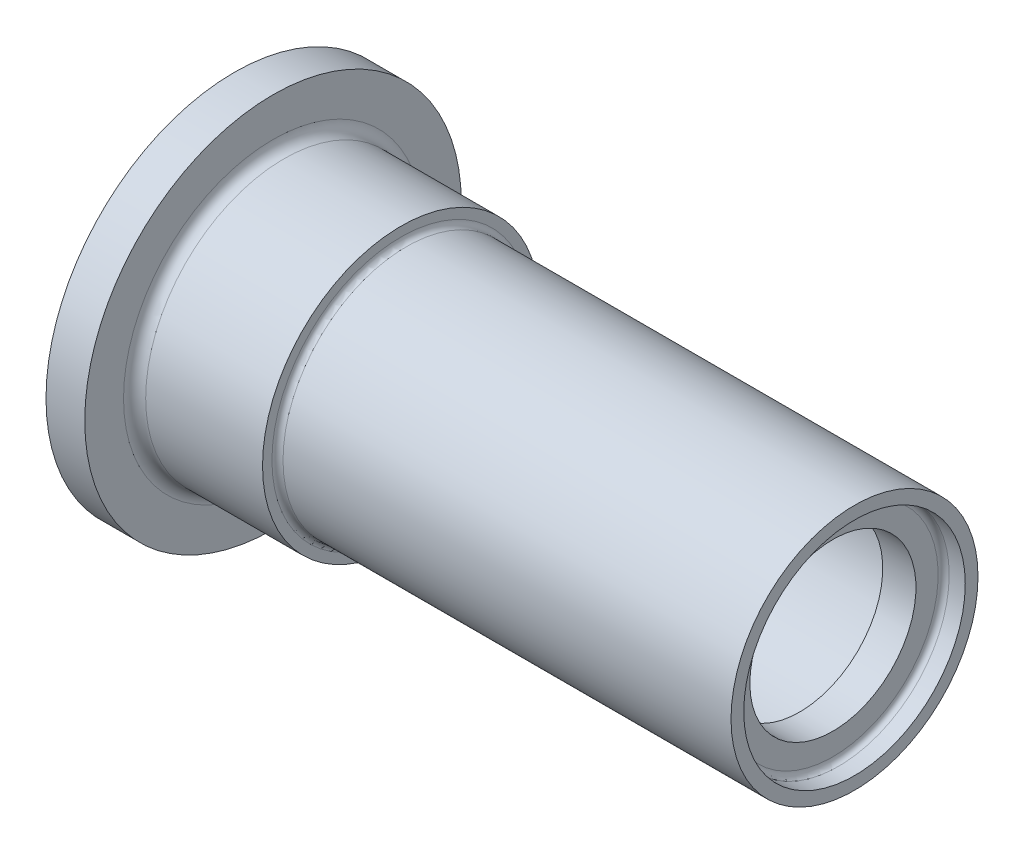
ISO-10303-21;
HEADER;
FILE_DESCRIPTION(('STEP AP214'),'2;1');
FILE_NAME('part.step','',(''),(''),'','','');
FILE_SCHEMA(('AUTOMOTIVE_DESIGN { 1 0 10303 214 1 1 1 1 }'));
ENDSEC;
DATA;
#1=APPLICATION_CONTEXT('core data for automotive mechanical design processes');
#2=APPLICATION_PROTOCOL_DEFINITION('international standard','automotive_design',2000,#1);
#3=PRODUCT_CONTEXT('',#1,'mechanical');
#4=PRODUCT('Part','Part','',(#3));
#5=PRODUCT_RELATED_PRODUCT_CATEGORY('part','',(#4));
#6=PRODUCT_DEFINITION_FORMATION('','',#4);
#7=PRODUCT_DEFINITION_CONTEXT('part definition',#1,'design');
#8=PRODUCT_DEFINITION('design','',#6,#7);
#9=PRODUCT_DEFINITION_SHAPE('','',#8);
#10=(LENGTH_UNIT() NAMED_UNIT(*) SI_UNIT(.MILLI.,.METRE.));
#11=(NAMED_UNIT(*) PLANE_ANGLE_UNIT() SI_UNIT($,.RADIAN.));
#12=(NAMED_UNIT(*) SI_UNIT($,.STERADIAN.) SOLID_ANGLE_UNIT());
#13=UNCERTAINTY_MEASURE_WITH_UNIT(LENGTH_MEASURE(1.E-05),#10,'distance_accuracy_value','');
#14=(GEOMETRIC_REPRESENTATION_CONTEXT(3) GLOBAL_UNCERTAINTY_ASSIGNED_CONTEXT((#13)) GLOBAL_UNIT_ASSIGNED_CONTEXT((#10,
#11,#12)) REPRESENTATION_CONTEXT('',''));
#15=CARTESIAN_POINT('',(0.,0.,0.));
#16=DIRECTION('',(0.,0.,1.));
#17=DIRECTION('',(1.,0.,0.));
#18=AXIS2_PLACEMENT_3D('',#15,#16,#17);
#19=CARTESIAN_POINT('',(-88.99,0.,0.));
#20=DIRECTION('',(-1.,0.,0.));
#21=DIRECTION('',(0.,0.,1.));
#22=AXIS2_PLACEMENT_3D('',#19,#20,#21);
#23=CYLINDRICAL_SURFACE('',#22,12.5);
#24=CARTESIAN_POINT('',(-10.55,0.,0.));
#25=DIRECTION('',(-1.,0.,0.));
#26=DIRECTION('',(0.,0.,1.));
#27=AXIS2_PLACEMENT_3D('',#24,#25,#26);
#28=CIRCLE('',#27,12.5);
#29=CARTESIAN_POINT('',(-10.55,0.,12.5));
#30=VERTEX_POINT('',#29);
#31=EDGE_CURVE('E10',#30,#30,#28,.T.);
#32=ORIENTED_EDGE('',*,*,#31,.F.);
#33=EDGE_LOOP('',(#32));
#34=FACE_BOUND('',#33,.T.);
#35=CARTESIAN_POINT('',(0.,0.,0.));
#36=DIRECTION('',(-1.,0.,0.));
#37=DIRECTION('',(0.,0.,1.));
#38=AXIS2_PLACEMENT_3D('',#35,#36,#37);
#39=CIRCLE('',#38,12.5);
#40=CARTESIAN_POINT('',(0.,0.,12.5));
#41=VERTEX_POINT('',#40);
#42=EDGE_CURVE('E121',#41,#41,#39,.T.);
#43=ORIENTED_EDGE('',*,*,#42,.T.);
#44=EDGE_LOOP('',(#43));
#45=FACE_BOUND('',#44,.T.);
#46=ADVANCED_FACE('F42',(#34,#45),#23,.T.);
#47=CARTESIAN_POINT('',(-10.55,0.,0.));
#48=DIRECTION('',(-1.,0.,0.));
#49=DIRECTION('',(0.,0.,1.));
#50=AXIS2_PLACEMENT_3D('',#47,#48,#49);
#51=TOROIDAL_SURFACE('',#50,13.5,1.);
#52=CARTESIAN_POINT('',(-11.55,0.,0.));
#53=DIRECTION('',(-1.,0.,0.));
#54=DIRECTION('',(0.,0.,1.));
#55=AXIS2_PLACEMENT_3D('',#52,#53,#54);
#56=CIRCLE('',#55,13.5);
#57=CARTESIAN_POINT('',(-11.55,0.,13.5));
#58=VERTEX_POINT('',#57);
#59=EDGE_CURVE('E49',#58,#58,#56,.T.);
#60=ORIENTED_EDGE('',*,*,#59,.F.);
#61=EDGE_LOOP('',(#60));
#62=FACE_BOUND('',#61,.T.);
#63=ORIENTED_EDGE('',*,*,#31,.T.);
#64=EDGE_LOOP('',(#63));
#65=FACE_BOUND('',#64,.T.);
#66=ADVANCED_FACE('F225',(#62,#65),#51,.F.);
#67=CARTESIAN_POINT('',(-11.55,17.,0.));
#68=DIRECTION('',(-1.,0.,0.));
#69=DIRECTION('',(0.,0.,1.));
#70=AXIS2_PLACEMENT_3D('',#67,#68,#69);
#71=PLANE('',#70);
#72=CARTESIAN_POINT('',(-11.55,0.,0.));
#73=DIRECTION('',(-1.,0.,0.));
#74=DIRECTION('',(0.,0.,1.));
#75=AXIS2_PLACEMENT_3D('',#72,#73,#74);
#76=CIRCLE('',#75,17.);
#77=CARTESIAN_POINT('',(-11.55,0.,17.));
#78=VERTEX_POINT('',#77);
#79=EDGE_CURVE('E54',#78,#78,#76,.T.);
#80=ORIENTED_EDGE('',*,*,#79,.F.);
#81=EDGE_LOOP('',(#80));
#82=FACE_BOUND('',#81,.T.);
#83=ORIENTED_EDGE('',*,*,#59,.T.);
#84=EDGE_LOOP('',(#83));
#85=FACE_BOUND('',#84,.T.);
#86=ADVANCED_FACE('F220',(#82,#85),#71,.F.);
#87=CARTESIAN_POINT('',(-88.99,0.,0.));
#88=DIRECTION('',(-1.,0.,0.));
#89=DIRECTION('',(0.,0.,1.));
#90=AXIS2_PLACEMENT_3D('',#87,#88,#89);
#91=CYLINDRICAL_SURFACE('',#90,17.);
#92=CARTESIAN_POINT('',(-15.05,0.,0.));
#93=DIRECTION('',(-1.,0.,0.));
#94=DIRECTION('',(0.,0.,1.));
#95=AXIS2_PLACEMENT_3D('',#92,#93,#94);
#96=CIRCLE('',#95,17.);
#97=CARTESIAN_POINT('',(-15.05,0.,17.));
#98=VERTEX_POINT('',#97);
#99=EDGE_CURVE('E59',#98,#98,#96,.T.);
#100=ORIENTED_EDGE('',*,*,#99,.F.);
#101=EDGE_LOOP('',(#100));
#102=FACE_BOUND('',#101,.T.);
#103=ORIENTED_EDGE('',*,*,#79,.T.);
#104=EDGE_LOOP('',(#103));
#105=FACE_BOUND('',#104,.T.);
#106=ADVANCED_FACE('F214',(#102,#105),#91,.T.);
#107=CARTESIAN_POINT('',(-15.05,15.,0.));
#108=DIRECTION('',(1.,0.,0.));
#109=DIRECTION('',(0.,0.,-1.));
#110=AXIS2_PLACEMENT_3D('',#107,#108,#109);
#111=PLANE('',#110);
#112=CARTESIAN_POINT('',(-15.05,0.,0.));
#113=DIRECTION('',(-1.,0.,0.));
#114=DIRECTION('',(0.,0.,1.));
#115=AXIS2_PLACEMENT_3D('',#112,#113,#114);
#116=CIRCLE('',#115,15.);
#117=CARTESIAN_POINT('',(-15.05,0.,15.));
#118=VERTEX_POINT('',#117);
#119=EDGE_CURVE('E65',#118,#118,#116,.T.);
#120=ORIENTED_EDGE('',*,*,#119,.F.);
#121=EDGE_LOOP('',(#120));
#122=FACE_BOUND('',#121,.T.);
#123=ORIENTED_EDGE('',*,*,#99,.T.);
#124=EDGE_LOOP('',(#123));
#125=FACE_BOUND('',#124,.T.);
#126=ADVANCED_FACE('F208',(#122,#125),#111,.F.);
#127=CARTESIAN_POINT('',(-88.99,0.,0.));
#128=DIRECTION('',(-1.,0.,0.));
#129=DIRECTION('',(0.,0.,1.));
#130=AXIS2_PLACEMENT_3D('',#127,#128,#129);
#131=CYLINDRICAL_SURFACE('',#130,15.);
#132=CARTESIAN_POINT('',(-14.05,0.,0.));
#133=DIRECTION('',(-1.,0.,0.));
#134=DIRECTION('',(0.,0.,1.));
#135=AXIS2_PLACEMENT_3D('',#132,#133,#134);
#136=CIRCLE('',#135,15.);
#137=CARTESIAN_POINT('',(-14.05,0.,15.));
#138=VERTEX_POINT('',#137);
#139=EDGE_CURVE('E69',#138,#138,#136,.T.);
#140=ORIENTED_EDGE('',*,*,#139,.F.);
#141=EDGE_LOOP('',(#140));
#142=FACE_BOUND('',#141,.T.);
#143=ORIENTED_EDGE('',*,*,#119,.T.);
#144=EDGE_LOOP('',(#143));
#145=FACE_BOUND('',#144,.T.);
#146=ADVANCED_FACE('F202',(#142,#145),#131,.F.);
#147=CARTESIAN_POINT('',(-14.05,0.,0.));
#148=DIRECTION('',(-1.,0.,0.));
#149=DIRECTION('',(0.,0.,1.));
#150=AXIS2_PLACEMENT_3D('',#147,#148,#149);
#151=TOROIDAL_SURFACE('',#150,14.5,0.5);
#152=CARTESIAN_POINT('',(-13.55,0.,0.));
#153=DIRECTION('',(-1.,0.,0.));
#154=DIRECTION('',(0.,0.,1.));
#155=AXIS2_PLACEMENT_3D('',#152,#153,#154);
#156=CIRCLE('',#155,14.5);
#157=CARTESIAN_POINT('',(-13.55,0.,14.5));
#158=VERTEX_POINT('',#157);
#159=EDGE_CURVE('E73',#158,#158,#156,.T.);
#160=ORIENTED_EDGE('',*,*,#159,.F.);
#161=EDGE_LOOP('',(#160));
#162=FACE_BOUND('',#161,.T.);
#163=ORIENTED_EDGE('',*,*,#139,.T.);
#164=EDGE_LOOP('',(#163));
#165=FACE_BOUND('',#164,.T.);
#166=ADVANCED_FACE('F196',(#162,#165),#151,.F.);
#167=CARTESIAN_POINT('',(-13.55,14.5,0.));
#168=DIRECTION('',(1.,0.,0.));
#169=DIRECTION('',(0.,0.,-1.));
#170=AXIS2_PLACEMENT_3D('',#167,#168,#169);
#171=PLANE('',#170);
#172=CARTESIAN_POINT('',(-13.55,0.,0.));
#173=DIRECTION('',(-1.,0.,0.));
#174=DIRECTION('',(0.,0.,1.));
#175=AXIS2_PLACEMENT_3D('',#172,#173,#174);
#176=CIRCLE('',#175,10.15);
#177=CARTESIAN_POINT('',(-13.55,0.,10.15));
#178=VERTEX_POINT('',#177);
#179=EDGE_CURVE('E77',#178,#178,#176,.T.);
#180=ORIENTED_EDGE('',*,*,#179,.F.);
#181=EDGE_LOOP('',(#180));
#182=FACE_BOUND('',#181,.T.);
#183=ORIENTED_EDGE('',*,*,#159,.T.);
#184=EDGE_LOOP('',(#183));
#185=FACE_BOUND('',#184,.T.);
#186=ADVANCED_FACE('F190',(#182,#185),#171,.F.);
#187=CARTESIAN_POINT('',(-88.99,0.,0.));
#188=DIRECTION('',(-1.,0.,0.));
#189=DIRECTION('',(0.,0.,1.));
#190=AXIS2_PLACEMENT_3D('',#187,#188,#189);
#191=CYLINDRICAL_SURFACE('',#190,10.15);
#192=CARTESIAN_POINT('',(34.5,0.,0.));
#193=DIRECTION('',(-1.,0.,0.));
#194=DIRECTION('',(0.,0.,1.));
#195=AXIS2_PLACEMENT_3D('',#192,#193,#194);
#196=CIRCLE('',#195,10.15);
#197=CARTESIAN_POINT('',(34.5,0.,10.15));
#198=VERTEX_POINT('',#197);
#199=EDGE_CURVE('E81',#198,#198,#196,.T.);
#200=ORIENTED_EDGE('',*,*,#199,.F.);
#201=EDGE_LOOP('',(#200));
#202=FACE_BOUND('',#201,.T.);
#203=ORIENTED_EDGE('',*,*,#179,.T.);
#204=EDGE_LOOP('',(#203));
#205=FACE_BOUND('',#204,.T.);
#206=ADVANCED_FACE('F184',(#202,#205),#191,.F.);
#207=CARTESIAN_POINT('',(34.5,0.,0.));
#208=DIRECTION('',(-1.,0.,0.));
#209=DIRECTION('',(0.,0.,1.));
#210=AXIS2_PLACEMENT_3D('',#207,#208,#209);
#211=TOROIDAL_SURFACE('',#210,8.65,1.5);
#212=CARTESIAN_POINT('',(36.,0.,0.));
#213=DIRECTION('',(-1.,0.,0.));
#214=DIRECTION('',(0.,0.,1.));
#215=AXIS2_PLACEMENT_3D('',#212,#213,#214);
#216=CIRCLE('',#215,8.65);
#217=CARTESIAN_POINT('',(36.,0.,8.65));
#218=VERTEX_POINT('',#217);
#219=EDGE_CURVE('E85',#218,#218,#216,.T.);
#220=ORIENTED_EDGE('',*,*,#219,.F.);
#221=EDGE_LOOP('',(#220));
#222=FACE_BOUND('',#221,.T.);
#223=ORIENTED_EDGE('',*,*,#199,.T.);
#224=EDGE_LOOP('',(#223));
#225=FACE_BOUND('',#224,.T.);
#226=ADVANCED_FACE('F178',(#222,#225),#211,.F.);
#227=CARTESIAN_POINT('',(36.,8.65,0.));
#228=DIRECTION('',(1.,0.,0.));
#229=DIRECTION('',(0.,0.,-1.));
#230=AXIS2_PLACEMENT_3D('',#227,#228,#229);
#231=PLANE('',#230);
#232=CARTESIAN_POINT('',(36.,0.,0.));
#233=DIRECTION('',(-1.,0.,0.));
#234=DIRECTION('',(0.,0.,1.));
#235=AXIS2_PLACEMENT_3D('',#232,#233,#234);
#236=CIRCLE('',#235,7.5);
#237=CARTESIAN_POINT('',(36.,0.,7.5));
#238=VERTEX_POINT('',#237);
#239=EDGE_CURVE('E89',#238,#238,#236,.T.);
#240=ORIENTED_EDGE('',*,*,#239,.F.);
#241=EDGE_LOOP('',(#240));
#242=FACE_BOUND('',#241,.T.);
#243=ORIENTED_EDGE('',*,*,#219,.T.);
#244=EDGE_LOOP('',(#243));
#245=FACE_BOUND('',#244,.T.);
#246=ADVANCED_FACE('F172',(#242,#245),#231,.F.);
#247=CARTESIAN_POINT('',(-88.99,0.,0.));
#248=DIRECTION('',(-1.,0.,0.));
#249=DIRECTION('',(0.,0.,1.));
#250=AXIS2_PLACEMENT_3D('',#247,#248,#249);
#251=CYLINDRICAL_SURFACE('',#250,7.5);
#252=CARTESIAN_POINT('',(39.,0.,0.));
#253=DIRECTION('',(-1.,0.,0.));
#254=DIRECTION('',(0.,0.,1.));
#255=AXIS2_PLACEMENT_3D('',#252,#253,#254);
#256=CIRCLE('',#255,7.5);
#257=CARTESIAN_POINT('',(39.,0.,7.5));
#258=VERTEX_POINT('',#257);
#259=EDGE_CURVE('E93',#258,#258,#256,.T.);
#260=ORIENTED_EDGE('',*,*,#259,.F.);
#261=EDGE_LOOP('',(#260));
#262=FACE_BOUND('',#261,.T.);
#263=ORIENTED_EDGE('',*,*,#239,.T.);
#264=EDGE_LOOP('',(#263));
#265=FACE_BOUND('',#264,.T.);
#266=ADVANCED_FACE('F166',(#262,#265),#251,.F.);
#267=CARTESIAN_POINT('',(39.,7.5,0.));
#268=DIRECTION('',(-1.,0.,0.));
#269=DIRECTION('',(0.,0.,1.));
#270=AXIS2_PLACEMENT_3D('',#267,#268,#269);
#271=PLANE('',#270);
#272=CARTESIAN_POINT('',(39.,0.,0.));
#273=DIRECTION('',(-1.,0.,0.));
#274=DIRECTION('',(0.,0.,1.));
#275=AXIS2_PLACEMENT_3D('',#272,#273,#274);
#276=CIRCLE('',#275,9.5);
#277=CARTESIAN_POINT('',(39.,0.,9.5));
#278=VERTEX_POINT('',#277);
#279=EDGE_CURVE('E97',#278,#278,#276,.T.);
#280=ORIENTED_EDGE('',*,*,#279,.F.);
#281=EDGE_LOOP('',(#280));
#282=FACE_BOUND('',#281,.T.);
#283=ORIENTED_EDGE('',*,*,#259,.T.);
#284=EDGE_LOOP('',(#283));
#285=FACE_BOUND('',#284,.T.);
#286=ADVANCED_FACE('F160',(#282,#285),#271,.F.);
#287=CARTESIAN_POINT('',(39.5,0.,0.));
#288=DIRECTION('',(-1.,0.,0.));
#289=DIRECTION('',(0.,0.,1.));
#290=AXIS2_PLACEMENT_3D('',#287,#288,#289);
#291=TOROIDAL_SURFACE('',#290,9.5,0.5);
#292=CARTESIAN_POINT('',(39.5,0.,0.));
#293=DIRECTION('',(-1.,0.,0.));
#294=DIRECTION('',(0.,0.,1.));
#295=AXIS2_PLACEMENT_3D('',#292,#293,#294);
#296=CIRCLE('',#295,10.);
#297=CARTESIAN_POINT('',(39.5,0.,10.));
#298=VERTEX_POINT('',#297);
#299=EDGE_CURVE('E101',#298,#298,#296,.T.);
#300=ORIENTED_EDGE('',*,*,#299,.F.);
#301=EDGE_LOOP('',(#300));
#302=FACE_BOUND('',#301,.T.);
#303=ORIENTED_EDGE('',*,*,#279,.T.);
#304=EDGE_LOOP('',(#303));
#305=FACE_BOUND('',#304,.T.);
#306=ADVANCED_FACE('F154',(#302,#305),#291,.F.);
#307=CARTESIAN_POINT('',(-88.99,0.,0.));
#308=DIRECTION('',(-1.,0.,0.));
#309=DIRECTION('',(0.,0.,1.));
#310=AXIS2_PLACEMENT_3D('',#307,#308,#309);
#311=CYLINDRICAL_SURFACE('',#310,10.);
#312=CARTESIAN_POINT('',(40.95,0.,0.));
#313=DIRECTION('',(-1.,0.,0.));
#314=DIRECTION('',(0.,0.,1.));
#315=AXIS2_PLACEMENT_3D('',#312,#313,#314);
#316=CIRCLE('',#315,10.);
#317=CARTESIAN_POINT('',(40.95,0.,10.));
#318=VERTEX_POINT('',#317);
#319=EDGE_CURVE('E105',#318,#318,#316,.T.);
#320=ORIENTED_EDGE('',*,*,#319,.F.);
#321=EDGE_LOOP('',(#320));
#322=FACE_BOUND('',#321,.T.);
#323=ORIENTED_EDGE('',*,*,#299,.T.);
#324=EDGE_LOOP('',(#323));
#325=FACE_BOUND('',#324,.T.);
#326=ADVANCED_FACE('F148',(#322,#325),#311,.F.);
#327=CARTESIAN_POINT('',(40.95,10.,0.));
#328=DIRECTION('',(-1.,0.,0.));
#329=DIRECTION('',(0.,0.,1.));
#330=AXIS2_PLACEMENT_3D('',#327,#328,#329);
#331=PLANE('',#330);
#332=CARTESIAN_POINT('',(40.95,0.,0.));
#333=DIRECTION('',(-1.,0.,0.));
#334=DIRECTION('',(0.,0.,1.));
#335=AXIS2_PLACEMENT_3D('',#332,#333,#334);
#336=CIRCLE('',#335,11.15);
#337=CARTESIAN_POINT('',(40.95,0.,11.15));
#338=VERTEX_POINT('',#337);
#339=EDGE_CURVE('E109',#338,#338,#336,.T.);
#340=ORIENTED_EDGE('',*,*,#339,.F.);
#341=EDGE_LOOP('',(#340));
#342=FACE_BOUND('',#341,.T.);
#343=ORIENTED_EDGE('',*,*,#319,.T.);
#344=EDGE_LOOP('',(#343));
#345=FACE_BOUND('',#344,.T.);
#346=ADVANCED_FACE('F142',(#342,#345),#331,.F.);
#347=CARTESIAN_POINT('',(-88.99,0.,0.));
#348=DIRECTION('',(-1.,0.,0.));
#349=DIRECTION('',(0.,0.,1.));
#350=AXIS2_PLACEMENT_3D('',#347,#348,#349);
#351=CYLINDRICAL_SURFACE('',#350,11.15);
#352=CARTESIAN_POINT('',(0.5,0.,0.));
#353=DIRECTION('',(-1.,0.,0.));
#354=DIRECTION('',(0.,0.,1.));
#355=AXIS2_PLACEMENT_3D('',#352,#353,#354);
#356=CIRCLE('',#355,11.15);
#357=CARTESIAN_POINT('',(0.5,0.,11.15));
#358=VERTEX_POINT('',#357);
#359=EDGE_CURVE('E113',#358,#358,#356,.T.);
#360=ORIENTED_EDGE('',*,*,#359,.F.);
#361=EDGE_LOOP('',(#360));
#362=FACE_BOUND('',#361,.T.);
#363=ORIENTED_EDGE('',*,*,#339,.T.);
#364=EDGE_LOOP('',(#363));
#365=FACE_BOUND('',#364,.T.);
#366=ADVANCED_FACE('F136',(#362,#365),#351,.T.);
#367=CARTESIAN_POINT('',(0.500000000000004,0.,0.));
#368=DIRECTION('',(-1.,0.,0.));
#369=DIRECTION('',(0.,0.,1.));
#370=AXIS2_PLACEMENT_3D('',#367,#368,#369);
#371=TOROIDAL_SURFACE('',#370,11.65,0.5);
#372=CARTESIAN_POINT('',(0.,0.,0.));
#373=DIRECTION('',(-1.,0.,0.));
#374=DIRECTION('',(0.,0.,1.));
#375=AXIS2_PLACEMENT_3D('',#372,#373,#374);
#376=CIRCLE('',#375,11.65);
#377=CARTESIAN_POINT('',(0.,0.,11.65));
#378=VERTEX_POINT('',#377);
#379=EDGE_CURVE('E117',#378,#378,#376,.T.);
#380=ORIENTED_EDGE('',*,*,#379,.F.);
#381=EDGE_LOOP('',(#380));
#382=FACE_BOUND('',#381,.T.);
#383=ORIENTED_EDGE('',*,*,#359,.T.);
#384=EDGE_LOOP('',(#383));
#385=FACE_BOUND('',#384,.T.);
#386=ADVANCED_FACE('F130',(#382,#385),#371,.F.);
#387=CARTESIAN_POINT('',(0.,12.5,0.));
#388=DIRECTION('',(-1.,0.,0.));
#389=DIRECTION('',(0.,0.,1.));
#390=AXIS2_PLACEMENT_3D('',#387,#388,#389);
#391=PLANE('',#390);
#392=ORIENTED_EDGE('',*,*,#42,.F.);
#393=EDGE_LOOP('',(#392));
#394=FACE_BOUND('',#393,.T.);
#395=ORIENTED_EDGE('',*,*,#379,.T.);
#396=EDGE_LOOP('',(#395));
#397=FACE_BOUND('',#396,.T.);
#398=ADVANCED_FACE('F127',(#394,#397),#391,.F.);
#399=CLOSED_SHELL('',(#46,#66,#86,#106,#126,#146,#166,#186,#206,#226,#246,#266,#286,#306,#326,
#346,#366,#386,#398));
#400=MANIFOLD_SOLID_BREP('B2',#399);
#401=ADVANCED_BREP_SHAPE_REPRESENTATION('',(#18,#400),#14);
#402=SHAPE_DEFINITION_REPRESENTATION(#9,#401);
ENDSEC;
END-ISO-10303-21;
